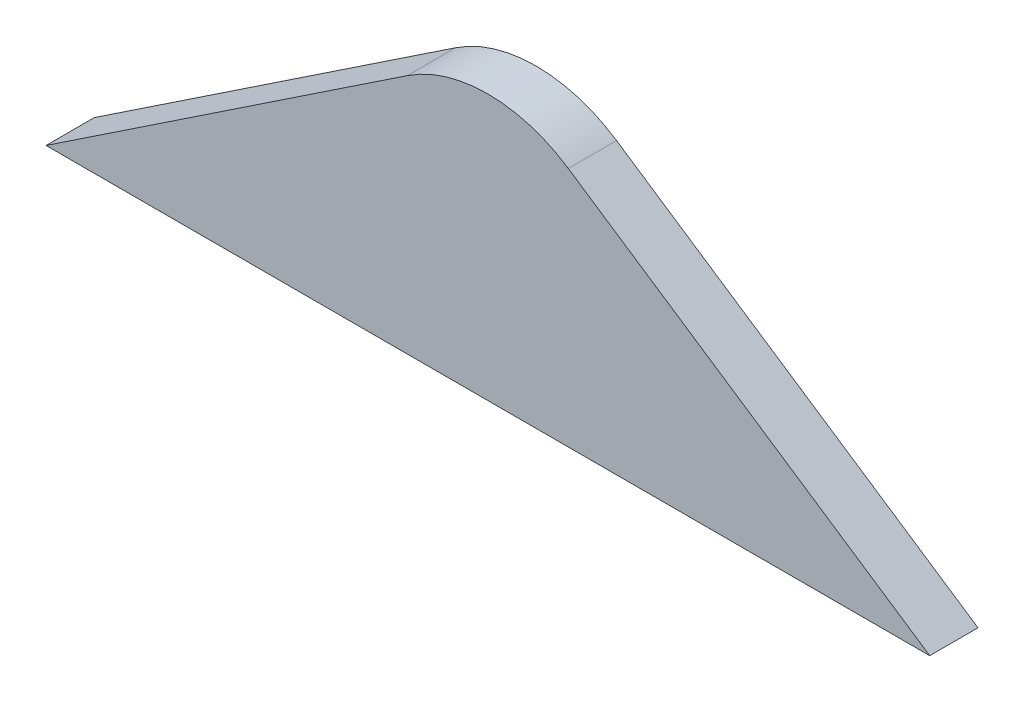
ISO-10303-21;
HEADER;
FILE_DESCRIPTION(('STEP AP214'),'2;1');
FILE_NAME('part.step','',(''),(''),'','','');
FILE_SCHEMA(('AUTOMOTIVE_DESIGN { 1 0 10303 214 1 1 1 1 }'));
ENDSEC;
DATA;
#1=APPLICATION_CONTEXT('core data for automotive mechanical design processes');
#2=APPLICATION_PROTOCOL_DEFINITION('international standard','automotive_design',2000,#1);
#3=PRODUCT_CONTEXT('',#1,'mechanical');
#4=PRODUCT('Part','Part','',(#3));
#5=PRODUCT_RELATED_PRODUCT_CATEGORY('part','',(#4));
#6=PRODUCT_DEFINITION_FORMATION('','',#4);
#7=PRODUCT_DEFINITION_CONTEXT('part definition',#1,'design');
#8=PRODUCT_DEFINITION('design','',#6,#7);
#9=PRODUCT_DEFINITION_SHAPE('','',#8);
#10=(LENGTH_UNIT() NAMED_UNIT(*) SI_UNIT(.MILLI.,.METRE.));
#11=(NAMED_UNIT(*) PLANE_ANGLE_UNIT() SI_UNIT($,.RADIAN.));
#12=(NAMED_UNIT(*) SI_UNIT($,.STERADIAN.) SOLID_ANGLE_UNIT());
#13=UNCERTAINTY_MEASURE_WITH_UNIT(LENGTH_MEASURE(1.E-05),#10,'distance_accuracy_value','');
#14=(GEOMETRIC_REPRESENTATION_CONTEXT(3) GLOBAL_UNCERTAINTY_ASSIGNED_CONTEXT((#13)) GLOBAL_UNIT_ASSIGNED_CONTEXT((#10,
#11,#12)) REPRESENTATION_CONTEXT('',''));
#15=CARTESIAN_POINT('',(0.,0.,0.));
#16=DIRECTION('',(0.,0.,1.));
#17=DIRECTION('',(1.,0.,0.));
#18=AXIS2_PLACEMENT_3D('',#15,#16,#17);
#19=CARTESIAN_POINT('',(0.,0.,10.));
#20=DIRECTION('',(0.555127180319756,-0.831765479970308,0.));
#21=DIRECTION('',(0.831765479970308,0.555127180319756,0.));
#22=AXIS2_PLACEMENT_3D('',#19,#20,#21);
#23=PLANE('',#22);
#24=DIRECTION('',(-0.831765479970308,-0.555127180319756,0.));
#25=VECTOR('',#24,1.);
#26=CARTESIAN_POINT('',(0.,0.,0.));
#27=LINE('',#26,#25);
#28=CARTESIAN_POINT('',(74.8461845904073,49.9529643991092,0.));
#29=VERTEX_POINT('',#28);
#30=CARTESIAN_POINT('',(0.,0.,0.));
#31=VERTEX_POINT('',#30);
#32=EDGE_CURVE('E107',#29,#31,#27,.T.);
#33=ORIENTED_EDGE('',*,*,#32,.T.);
#34=DIRECTION('',(0.,0.,-1.));
#35=VECTOR('',#34,1.);
#36=CARTESIAN_POINT('',(0.,0.,10.));
#37=LINE('',#36,#35);
#38=CARTESIAN_POINT('',(0.,0.,10.));
#39=VERTEX_POINT('',#38);
#40=EDGE_CURVE('E11',#39,#31,#37,.T.);
#41=ORIENTED_EDGE('',*,*,#40,.F.);
#42=DIRECTION('',(-0.831765479970308,-0.555127180319756,0.));
#43=VECTOR('',#42,1.);
#44=CARTESIAN_POINT('',(0.,0.,10.));
#45=LINE('',#44,#43);
#46=CARTESIAN_POINT('',(74.8461845904073,49.9529643991092,10.));
#47=VERTEX_POINT('',#46);
#48=EDGE_CURVE('E91',#47,#39,#45,.T.);
#49=ORIENTED_EDGE('',*,*,#48,.F.);
#50=DIRECTION('',(0.,0.,-1.));
#51=VECTOR('',#50,1.);
#52=CARTESIAN_POINT('',(74.8461845904073,49.9529643991092,10.));
#53=LINE('',#52,#51);
#54=EDGE_CURVE('E103',#47,#29,#53,.T.);
#55=ORIENTED_EDGE('',*,*,#54,.T.);
#56=EDGE_LOOP('',(#33,#41,#49,#55));
#57=FACE_BOUND('',#56,.T.);
#58=ADVANCED_FACE('F39',(#57),#23,.F.);
#59=CARTESIAN_POINT('',(0.,0.,10.));
#60=DIRECTION('',(0.,1.,0.));
#61=DIRECTION('',(0.,0.,1.));
#62=AXIS2_PLACEMENT_3D('',#59,#60,#61);
#63=PLANE('',#62);
#64=DIRECTION('',(1.,0.,0.));
#65=VECTOR('',#64,1.);
#66=CARTESIAN_POINT('',(0.,0.,0.));
#67=LINE('',#66,#65);
#68=CARTESIAN_POINT('',(183.,0.,0.));
#69=VERTEX_POINT('',#68);
#70=EDGE_CURVE('E96',#31,#69,#67,.T.);
#71=ORIENTED_EDGE('',*,*,#70,.T.);
#72=DIRECTION('',(0.,0.,-1.));
#73=VECTOR('',#72,1.);
#74=CARTESIAN_POINT('',(183.,0.,10.));
#75=LINE('',#74,#73);
#76=CARTESIAN_POINT('',(183.,0.,10.));
#77=VERTEX_POINT('',#76);
#78=EDGE_CURVE('E48',#77,#69,#75,.T.);
#79=ORIENTED_EDGE('',*,*,#78,.F.);
#80=DIRECTION('',(1.,0.,0.));
#81=VECTOR('',#80,1.);
#82=CARTESIAN_POINT('',(0.,0.,10.));
#83=LINE('',#82,#81);
#84=EDGE_CURVE('E86',#39,#77,#83,.T.);
#85=ORIENTED_EDGE('',*,*,#84,.F.);
#86=ORIENTED_EDGE('',*,*,#40,.T.);
#87=EDGE_LOOP('',(#71,#79,#85,#86));
#88=FACE_BOUND('',#87,.T.);
#89=ADVANCED_FACE('F95',(#88),#63,.F.);
#90=CARTESIAN_POINT('',(183.,0.,10.));
#91=DIRECTION('',(-0.555127180319756,-0.831765479970308,0.));
#92=DIRECTION('',(0.831765479970308,-0.555127180319756,0.));
#93=AXIS2_PLACEMENT_3D('',#90,#91,#92);
#94=PLANE('',#93);
#95=DIRECTION('',(-0.831765479970308,0.555127180319756,0.));
#96=VECTOR('',#95,1.);
#97=CARTESIAN_POINT('',(183.,0.,0.));
#98=LINE('',#97,#96);
#99=CARTESIAN_POINT('',(108.153815409593,49.9529643991092,0.));
#100=VERTEX_POINT('',#99);
#101=EDGE_CURVE('E73',#69,#100,#98,.T.);
#102=ORIENTED_EDGE('',*,*,#101,.T.);
#103=DIRECTION('',(0.,0.,-1.));
#104=VECTOR('',#103,1.);
#105=CARTESIAN_POINT('',(108.153815409593,49.9529643991092,10.));
#106=LINE('',#105,#104);
#107=CARTESIAN_POINT('',(108.153815409593,49.9529643991092,10.));
#108=VERTEX_POINT('',#107);
#109=EDGE_CURVE('E98',#108,#100,#106,.T.);
#110=ORIENTED_EDGE('',*,*,#109,.F.);
#111=DIRECTION('',(-0.831765479970308,0.555127180319756,0.));
#112=VECTOR('',#111,1.);
#113=CARTESIAN_POINT('',(183.,0.,10.));
#114=LINE('',#113,#112);
#115=EDGE_CURVE('E89',#77,#108,#114,.T.);
#116=ORIENTED_EDGE('',*,*,#115,.F.);
#117=ORIENTED_EDGE('',*,*,#78,.T.);
#118=EDGE_LOOP('',(#102,#110,#116,#117));
#119=FACE_BOUND('',#118,.T.);
#120=ADVANCED_FACE('F99',(#119),#94,.F.);
#121=CARTESIAN_POINT('',(91.5,25.,10.));
#122=DIRECTION('',(0.,0.,-1.));
#123=DIRECTION('',(-1.,0.,0.));
#124=AXIS2_PLACEMENT_3D('',#121,#122,#123);
#125=CYLINDRICAL_SURFACE('',#124,30.);
#126=CARTESIAN_POINT('',(91.5,25.,0.));
#127=DIRECTION('',(0.,0.,1.));
#128=DIRECTION('',(-1.,0.,0.));
#129=AXIS2_PLACEMENT_3D('',#126,#127,#128);
#130=CIRCLE('',#129,30.);
#131=EDGE_CURVE('E79',#100,#29,#130,.T.);
#132=ORIENTED_EDGE('',*,*,#131,.T.);
#133=ORIENTED_EDGE('',*,*,#54,.F.);
#134=CARTESIAN_POINT('',(91.5,25.,10.));
#135=DIRECTION('',(0.,0.,1.));
#136=DIRECTION('',(-1.,0.,0.));
#137=AXIS2_PLACEMENT_3D('',#134,#135,#136);
#138=CIRCLE('',#137,30.);
#139=EDGE_CURVE('E56',#108,#47,#138,.T.);
#140=ORIENTED_EDGE('',*,*,#139,.F.);
#141=ORIENTED_EDGE('',*,*,#109,.T.);
#142=EDGE_LOOP('',(#132,#133,#140,#141));
#143=FACE_BOUND('',#142,.T.);
#144=ADVANCED_FACE('F120',(#143),#125,.T.);
#145=CARTESIAN_POINT('',(91.5,25.,10.));
#146=DIRECTION('',(0.,0.,-1.));
#147=DIRECTION('',(-1.,0.,0.));
#148=AXIS2_PLACEMENT_3D('',#145,#146,#147);
#149=PLANE('',#148);
#150=ORIENTED_EDGE('',*,*,#48,.T.);
#151=ORIENTED_EDGE('',*,*,#84,.T.);
#152=ORIENTED_EDGE('',*,*,#115,.T.);
#153=ORIENTED_EDGE('',*,*,#139,.T.);
#154=EDGE_LOOP('',(#150,#151,#152,#153));
#155=FACE_BOUND('',#154,.T.);
#156=ADVANCED_FACE('F87',(#155),#149,.F.);
#157=CARTESIAN_POINT('',(91.5,25.,0.));
#158=DIRECTION('',(0.,0.,-1.));
#159=DIRECTION('',(-1.,0.,0.));
#160=AXIS2_PLACEMENT_3D('',#157,#158,#159);
#161=PLANE('',#160);
#162=ORIENTED_EDGE('',*,*,#32,.F.);
#163=ORIENTED_EDGE('',*,*,#131,.F.);
#164=ORIENTED_EDGE('',*,*,#101,.F.);
#165=ORIENTED_EDGE('',*,*,#70,.F.);
#166=EDGE_LOOP('',(#162,#163,#164,#165));
#167=FACE_BOUND('',#166,.T.);
#168=ADVANCED_FACE('F123',(#167),#161,.T.);
#169=CLOSED_SHELL('',(#58,#89,#120,#144,#156,#168));
#170=MANIFOLD_SOLID_BREP('B2',#169);
#171=ADVANCED_BREP_SHAPE_REPRESENTATION('',(#18,#170),#14);
#172=SHAPE_DEFINITION_REPRESENTATION(#9,#171);
ENDSEC;
END-ISO-10303-21;
